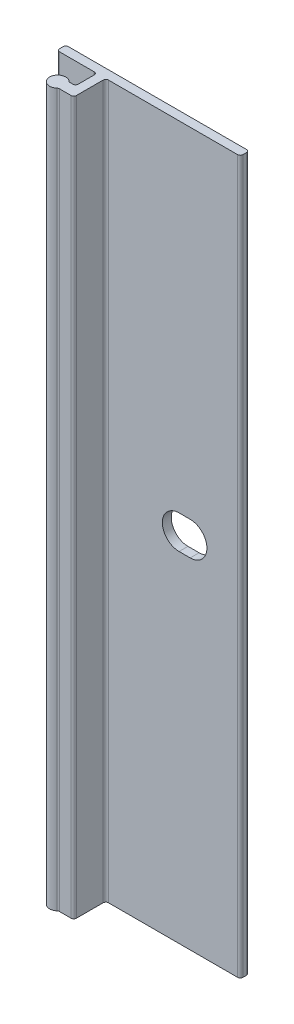
ISO-10303-21;
HEADER;
FILE_DESCRIPTION(('STEP AP214'),'2;1');
FILE_NAME('part.step','',(''),(''),'','','');
FILE_SCHEMA(('AUTOMOTIVE_DESIGN { 1 0 10303 214 1 1 1 1 }'));
ENDSEC;
DATA;
#1=APPLICATION_CONTEXT('core data for automotive mechanical design processes');
#2=APPLICATION_PROTOCOL_DEFINITION('international standard','automotive_design',2000,#1);
#3=PRODUCT_CONTEXT('',#1,'mechanical');
#4=PRODUCT('Part','Part','',(#3));
#5=PRODUCT_RELATED_PRODUCT_CATEGORY('part','',(#4));
#6=PRODUCT_DEFINITION_FORMATION('','',#4);
#7=PRODUCT_DEFINITION_CONTEXT('part definition',#1,'design');
#8=PRODUCT_DEFINITION('design','',#6,#7);
#9=PRODUCT_DEFINITION_SHAPE('','',#8);
#10=(LENGTH_UNIT() NAMED_UNIT(*) SI_UNIT(.MILLI.,.METRE.));
#11=(NAMED_UNIT(*) PLANE_ANGLE_UNIT() SI_UNIT($,.RADIAN.));
#12=(NAMED_UNIT(*) SI_UNIT($,.STERADIAN.) SOLID_ANGLE_UNIT());
#13=UNCERTAINTY_MEASURE_WITH_UNIT(LENGTH_MEASURE(1.E-05),#10,'distance_accuracy_value','');
#14=(GEOMETRIC_REPRESENTATION_CONTEXT(3) GLOBAL_UNCERTAINTY_ASSIGNED_CONTEXT((#13)) GLOBAL_UNIT_ASSIGNED_CONTEXT((#10,
#11,#12)) REPRESENTATION_CONTEXT('',''));
#15=CARTESIAN_POINT('',(0.,0.,0.));
#16=DIRECTION('',(0.,0.,1.));
#17=DIRECTION('',(1.,0.,0.));
#18=AXIS2_PLACEMENT_3D('',#15,#16,#17);
#19=CARTESIAN_POINT('',(-5.33400000000001,50.8,0.381));
#20=DIRECTION('',(0.,-1.,0.));
#21=DIRECTION('',(0.,0.,-1.));
#22=AXIS2_PLACEMENT_3D('',#19,#20,#21);
#23=CYLINDRICAL_SURFACE('',#22,0.381);
#24=CARTESIAN_POINT('',(-5.33400000000001,-50.8,0.381));
#25=DIRECTION('',(0.,1.,0.));
#26=DIRECTION('',(0.,0.,-1.));
#27=AXIS2_PLACEMENT_3D('',#24,#25,#26);
#28=CIRCLE('',#27,0.381);
#29=CARTESIAN_POINT('',(-5.33400000000001,-50.8,0.));
#30=VERTEX_POINT('',#29);
#31=CARTESIAN_POINT('',(-5.71500000000001,-50.8,0.381));
#32=VERTEX_POINT('',#31);
#33=EDGE_CURVE('E239',#30,#32,#28,.T.);
#34=ORIENTED_EDGE('',*,*,#33,.T.);
#35=DIRECTION('',(0.,-1.,0.));
#36=VECTOR('',#35,1.);
#37=CARTESIAN_POINT('',(-5.71500000000001,50.8,0.381));
#38=LINE('',#37,#36);
#39=CARTESIAN_POINT('',(-5.71500000000001,50.8,0.381));
#40=VERTEX_POINT('',#39);
#41=EDGE_CURVE('E13',#40,#32,#38,.T.);
#42=ORIENTED_EDGE('',*,*,#41,.F.);
#43=CARTESIAN_POINT('',(-5.33400000000001,50.8,0.381));
#44=DIRECTION('',(0.,1.,0.));
#45=DIRECTION('',(0.,0.,-1.));
#46=AXIS2_PLACEMENT_3D('',#43,#44,#45);
#47=CIRCLE('',#46,0.381);
#48=CARTESIAN_POINT('',(-5.33400000000001,50.8,0.));
#49=VERTEX_POINT('',#48);
#50=EDGE_CURVE('E243',#49,#40,#47,.T.);
#51=ORIENTED_EDGE('',*,*,#50,.F.);
#52=DIRECTION('',(0.,-1.,0.));
#53=VECTOR('',#52,1.);
#54=CARTESIAN_POINT('',(-5.33400000000001,50.8,0.));
#55=LINE('',#54,#53);
#56=EDGE_CURVE('E285',#49,#30,#55,.T.);
#57=ORIENTED_EDGE('',*,*,#56,.T.);
#58=EDGE_LOOP('',(#34,#42,#51,#57));
#59=FACE_BOUND('',#58,.T.);
#60=ADVANCED_FACE('F46',(#59),#23,.T.);
#61=CARTESIAN_POINT('',(-5.71500000000001,50.8,0.889000000000005));
#62=DIRECTION('',(1.,0.,0.));
#63=DIRECTION('',(0.,0.,-1.));
#64=AXIS2_PLACEMENT_3D('',#61,#62,#63);
#65=PLANE('',#64);
#66=DIRECTION('',(0.,0.,1.));
#67=VECTOR('',#66,1.);
#68=CARTESIAN_POINT('',(-5.71500000000001,-50.8,0.889000000000005));
#69=LINE('',#68,#67);
#70=CARTESIAN_POINT('',(-5.71500000000001,-50.8,0.889000000000005));
#71=VERTEX_POINT('',#70);
#72=EDGE_CURVE('E288',#32,#71,#69,.T.);
#73=ORIENTED_EDGE('',*,*,#72,.T.);
#74=DIRECTION('',(0.,-1.,0.));
#75=VECTOR('',#74,1.);
#76=CARTESIAN_POINT('',(-5.71500000000001,50.8,0.889000000000005));
#77=LINE('',#76,#75);
#78=CARTESIAN_POINT('',(-5.71500000000001,50.8,0.889000000000005));
#79=VERTEX_POINT('',#78);
#80=EDGE_CURVE('E53',#79,#71,#77,.T.);
#81=ORIENTED_EDGE('',*,*,#80,.F.);
#82=DIRECTION('',(0.,0.,1.));
#83=VECTOR('',#82,1.);
#84=CARTESIAN_POINT('',(-5.71500000000001,50.8,0.889000000000005));
#85=LINE('',#84,#83);
#86=EDGE_CURVE('E246',#40,#79,#85,.T.);
#87=ORIENTED_EDGE('',*,*,#86,.F.);
#88=ORIENTED_EDGE('',*,*,#41,.T.);
#89=EDGE_LOOP('',(#73,#81,#87,#88));
#90=FACE_BOUND('',#89,.T.);
#91=ADVANCED_FACE('F405',(#90),#65,.F.);
#92=CARTESIAN_POINT('',(-5.33400000000001,50.8,0.889000000000004));
#93=DIRECTION('',(0.,-1.,0.));
#94=DIRECTION('',(0.,0.,-1.));
#95=AXIS2_PLACEMENT_3D('',#92,#93,#94);
#96=CYLINDRICAL_SURFACE('',#95,0.381);
#97=CARTESIAN_POINT('',(-5.33400000000001,-50.8,0.889000000000004));
#98=DIRECTION('',(0.,1.,0.));
#99=DIRECTION('',(0.,0.,-1.));
#100=AXIS2_PLACEMENT_3D('',#97,#98,#99);
#101=CIRCLE('',#100,0.381);
#102=CARTESIAN_POINT('',(-5.33400000000001,-50.8,1.27));
#103=VERTEX_POINT('',#102);
#104=EDGE_CURVE('E290',#71,#103,#101,.T.);
#105=ORIENTED_EDGE('',*,*,#104,.T.);
#106=DIRECTION('',(0.,-1.,0.));
#107=VECTOR('',#106,1.);
#108=CARTESIAN_POINT('',(-5.33400000000001,50.8,1.27));
#109=LINE('',#108,#107);
#110=CARTESIAN_POINT('',(-5.33400000000001,50.8,1.27));
#111=VERTEX_POINT('',#110);
#112=EDGE_CURVE('E375',#111,#103,#109,.T.);
#113=ORIENTED_EDGE('',*,*,#112,.F.);
#114=CARTESIAN_POINT('',(-5.33400000000001,50.8,0.889000000000004));
#115=DIRECTION('',(0.,1.,0.));
#116=DIRECTION('',(0.,0.,-1.));
#117=AXIS2_PLACEMENT_3D('',#114,#115,#116);
#118=CIRCLE('',#117,0.381);
#119=EDGE_CURVE('E249',#79,#111,#118,.T.);
#120=ORIENTED_EDGE('',*,*,#119,.F.);
#121=ORIENTED_EDGE('',*,*,#80,.T.);
#122=EDGE_LOOP('',(#105,#113,#120,#121));
#123=FACE_BOUND('',#122,.T.);
#124=ADVANCED_FACE('F382',(#123),#96,.T.);
#125=CARTESIAN_POINT('',(-0.381,50.8,1.27));
#126=DIRECTION('',(0.,0.,-1.));
#127=DIRECTION('',(-1.,0.,0.));
#128=AXIS2_PLACEMENT_3D('',#125,#126,#127);
#129=PLANE('',#128);
#130=DIRECTION('',(1.,0.,0.));
#131=VECTOR('',#130,1.);
#132=CARTESIAN_POINT('',(-0.381,-50.8,1.27));
#133=LINE('',#132,#131);
#134=CARTESIAN_POINT('',(-0.381,-50.8,1.27));
#135=VERTEX_POINT('',#134);
#136=EDGE_CURVE('E292',#103,#135,#133,.T.);
#137=ORIENTED_EDGE('',*,*,#136,.T.);
#138=DIRECTION('',(0.,-1.,0.));
#139=VECTOR('',#138,1.);
#140=CARTESIAN_POINT('',(-0.381,50.8,1.27));
#141=LINE('',#140,#139);
#142=CARTESIAN_POINT('',(-0.381,50.8,1.27));
#143=VERTEX_POINT('',#142);
#144=EDGE_CURVE('E372',#143,#135,#141,.T.);
#145=ORIENTED_EDGE('',*,*,#144,.F.);
#146=DIRECTION('',(1.,0.,0.));
#147=VECTOR('',#146,1.);
#148=CARTESIAN_POINT('',(-0.381,50.8,1.27));
#149=LINE('',#148,#147);
#150=EDGE_CURVE('E251',#111,#143,#149,.T.);
#151=ORIENTED_EDGE('',*,*,#150,.F.);
#152=ORIENTED_EDGE('',*,*,#112,.T.);
#153=EDGE_LOOP('',(#137,#145,#151,#152));
#154=FACE_BOUND('',#153,.T.);
#155=ADVANCED_FACE('F393',(#154),#129,.F.);
#156=CARTESIAN_POINT('',(-0.381,50.8,1.651));
#157=DIRECTION('',(0.,-1.,0.));
#158=DIRECTION('',(0.,0.,-1.));
#159=AXIS2_PLACEMENT_3D('',#156,#157,#158);
#160=CYLINDRICAL_SURFACE('',#159,0.381);
#161=CARTESIAN_POINT('',(-0.381,-50.8,1.651));
#162=DIRECTION('',(0.,-1.,0.));
#163=DIRECTION('',(0.,0.,-1.));
#164=AXIS2_PLACEMENT_3D('',#161,#162,#163);
#165=CIRCLE('',#164,0.381);
#166=CARTESIAN_POINT('',(0.,-50.8,1.651));
#167=VERTEX_POINT('',#166);
#168=EDGE_CURVE('E294',#135,#167,#165,.T.);
#169=ORIENTED_EDGE('',*,*,#168,.T.);
#170=DIRECTION('',(0.,-1.,0.));
#171=VECTOR('',#170,1.);
#172=CARTESIAN_POINT('',(0.,50.8,1.651));
#173=LINE('',#172,#171);
#174=CARTESIAN_POINT('',(0.,50.8,1.651));
#175=VERTEX_POINT('',#174);
#176=EDGE_CURVE('E369',#175,#167,#173,.T.);
#177=ORIENTED_EDGE('',*,*,#176,.F.);
#178=CARTESIAN_POINT('',(-0.381,50.8,1.651));
#179=DIRECTION('',(0.,-1.,0.));
#180=DIRECTION('',(0.,0.,-1.));
#181=AXIS2_PLACEMENT_3D('',#178,#179,#180);
#182=CIRCLE('',#181,0.381);
#183=EDGE_CURVE('E253',#143,#175,#182,.T.);
#184=ORIENTED_EDGE('',*,*,#183,.F.);
#185=ORIENTED_EDGE('',*,*,#144,.T.);
#186=EDGE_LOOP('',(#169,#177,#184,#185));
#187=FACE_BOUND('',#186,.T.);
#188=ADVANCED_FACE('F397',(#187),#160,.F.);
#189=CARTESIAN_POINT('',(0.,50.8,1.651));
#190=DIRECTION('',(1.,0.,0.));
#191=DIRECTION('',(0.,0.,-1.));
#192=AXIS2_PLACEMENT_3D('',#189,#190,#191);
#193=PLANE('',#192);
#194=DIRECTION('',(0.,0.,1.));
#195=VECTOR('',#194,1.);
#196=CARTESIAN_POINT('',(0.,-50.8,1.651));
#197=LINE('',#196,#195);
#198=CARTESIAN_POINT('',(0.,-50.8,3.937));
#199=VERTEX_POINT('',#198);
#200=EDGE_CURVE('E296',#167,#199,#197,.T.);
#201=ORIENTED_EDGE('',*,*,#200,.T.);
#202=DIRECTION('',(0.,-1.,0.));
#203=VECTOR('',#202,1.);
#204=CARTESIAN_POINT('',(0.,50.8,3.937));
#205=LINE('',#204,#203);
#206=CARTESIAN_POINT('',(0.,50.8,3.937));
#207=VERTEX_POINT('',#206);
#208=EDGE_CURVE('E366',#207,#199,#205,.T.);
#209=ORIENTED_EDGE('',*,*,#208,.F.);
#210=DIRECTION('',(0.,0.,1.));
#211=VECTOR('',#210,1.);
#212=CARTESIAN_POINT('',(0.,50.8,1.651));
#213=LINE('',#212,#211);
#214=EDGE_CURVE('E255',#175,#207,#213,.T.);
#215=ORIENTED_EDGE('',*,*,#214,.F.);
#216=ORIENTED_EDGE('',*,*,#176,.T.);
#217=EDGE_LOOP('',(#201,#209,#215,#216));
#218=FACE_BOUND('',#217,.T.);
#219=ADVANCED_FACE('F476',(#218),#193,.F.);
#220=CARTESIAN_POINT('',(-0.381,50.8,3.937));
#221=DIRECTION('',(0.,-1.,0.));
#222=DIRECTION('',(0.,0.,-1.));
#223=AXIS2_PLACEMENT_3D('',#220,#221,#222);
#224=CYLINDRICAL_SURFACE('',#223,0.381);
#225=CARTESIAN_POINT('',(-0.381,-50.8,3.937));
#226=DIRECTION('',(0.,-1.,0.));
#227=DIRECTION('',(0.,0.,-1.));
#228=AXIS2_PLACEMENT_3D('',#225,#226,#227);
#229=CIRCLE('',#228,0.381);
#230=CARTESIAN_POINT('',(-0.381,-50.8,4.318));
#231=VERTEX_POINT('',#230);
#232=EDGE_CURVE('E298',#199,#231,#229,.T.);
#233=ORIENTED_EDGE('',*,*,#232,.T.);
#234=DIRECTION('',(0.,-1.,0.));
#235=VECTOR('',#234,1.);
#236=CARTESIAN_POINT('',(-0.381,50.8,4.318));
#237=LINE('',#236,#235);
#238=CARTESIAN_POINT('',(-0.381,50.8,4.318));
#239=VERTEX_POINT('',#238);
#240=EDGE_CURVE('E363',#239,#231,#237,.T.);
#241=ORIENTED_EDGE('',*,*,#240,.F.);
#242=CARTESIAN_POINT('',(-0.381,50.8,3.937));
#243=DIRECTION('',(0.,-1.,0.));
#244=DIRECTION('',(0.,0.,-1.));
#245=AXIS2_PLACEMENT_3D('',#242,#243,#244);
#246=CIRCLE('',#245,0.381);
#247=EDGE_CURVE('E257',#207,#239,#246,.T.);
#248=ORIENTED_EDGE('',*,*,#247,.F.);
#249=ORIENTED_EDGE('',*,*,#208,.T.);
#250=EDGE_LOOP('',(#233,#241,#248,#249));
#251=FACE_BOUND('',#250,.T.);
#252=ADVANCED_FACE('F474',(#251),#224,.F.);
#253=CARTESIAN_POINT('',(-0.76996875048439,50.8,4.318));
#254=DIRECTION('',(0.,0.,1.));
#255=DIRECTION('',(1.,0.,0.));
#256=AXIS2_PLACEMENT_3D('',#253,#254,#255);
#257=PLANE('',#256);
#258=DIRECTION('',(-1.,0.,0.));
#259=VECTOR('',#258,1.);
#260=CARTESIAN_POINT('',(-0.76996875048439,-50.8,4.318));
#261=LINE('',#260,#259);
#262=CARTESIAN_POINT('',(-0.76996875048439,-50.8,4.318));
#263=VERTEX_POINT('',#262);
#264=EDGE_CURVE('E300',#231,#263,#261,.T.);
#265=ORIENTED_EDGE('',*,*,#264,.T.);
#266=DIRECTION('',(0.,-1.,0.));
#267=VECTOR('',#266,1.);
#268=CARTESIAN_POINT('',(-0.76996875048439,50.8,4.318));
#269=LINE('',#268,#267);
#270=CARTESIAN_POINT('',(-0.76996875048439,50.8,4.318));
#271=VERTEX_POINT('',#270);
#272=EDGE_CURVE('E360',#271,#263,#269,.T.);
#273=ORIENTED_EDGE('',*,*,#272,.F.);
#274=DIRECTION('',(-1.,0.,0.));
#275=VECTOR('',#274,1.);
#276=CARTESIAN_POINT('',(-0.76996875048439,50.8,4.318));
#277=LINE('',#276,#275);
#278=EDGE_CURVE('E259',#239,#271,#277,.T.);
#279=ORIENTED_EDGE('',*,*,#278,.F.);
#280=ORIENTED_EDGE('',*,*,#240,.T.);
#281=EDGE_LOOP('',(#265,#273,#279,#280));
#282=FACE_BOUND('',#281,.T.);
#283=ADVANCED_FACE('F469',(#282),#257,.F.);
#284=CARTESIAN_POINT('',(-0.76996875048439,50.8,3.937));
#285=DIRECTION('',(0.,-1.,0.));
#286=DIRECTION('',(0.,0.,-1.));
#287=AXIS2_PLACEMENT_3D('',#284,#285,#286);
#288=CYLINDRICAL_SURFACE('',#287,0.381000000000001);
#289=CARTESIAN_POINT('',(-0.76996875048439,-50.8,3.937));
#290=DIRECTION('',(0.,-1.,0.));
#291=DIRECTION('',(0.,0.,-1.));
#292=AXIS2_PLACEMENT_3D('',#289,#290,#291);
#293=CIRCLE('',#292,0.381000000000001);
#294=CARTESIAN_POINT('',(-1.02197656286329,-50.8,4.22275));
#295=VERTEX_POINT('',#294);
#296=EDGE_CURVE('E302',#263,#295,#293,.T.);
#297=ORIENTED_EDGE('',*,*,#296,.T.);
#298=DIRECTION('',(0.,-1.,0.));
#299=VECTOR('',#298,1.);
#300=CARTESIAN_POINT('',(-1.02197656286329,50.8,4.22275));
#301=LINE('',#300,#299);
#302=CARTESIAN_POINT('',(-1.02197656286329,50.8,4.22275));
#303=VERTEX_POINT('',#302);
#304=EDGE_CURVE('E357',#303,#295,#301,.T.);
#305=ORIENTED_EDGE('',*,*,#304,.F.);
#306=CARTESIAN_POINT('',(-0.76996875048439,50.8,3.937));
#307=DIRECTION('',(0.,-1.,0.));
#308=DIRECTION('',(0.,0.,-1.));
#309=AXIS2_PLACEMENT_3D('',#306,#307,#308);
#310=CIRCLE('',#309,0.381000000000001);
#311=EDGE_CURVE('E261',#271,#303,#310,.T.);
#312=ORIENTED_EDGE('',*,*,#311,.F.);
#313=ORIENTED_EDGE('',*,*,#272,.T.);
#314=EDGE_LOOP('',(#297,#305,#312,#313));
#315=FACE_BOUND('',#314,.T.);
#316=ADVANCED_FACE('F464',(#315),#288,.F.);
#317=CARTESIAN_POINT('',(-1.778,50.8,5.08));
#318=DIRECTION('',(0.,-1.,0.));
#319=DIRECTION('',(0.,0.,-1.));
#320=AXIS2_PLACEMENT_3D('',#317,#318,#319);
#321=CYLINDRICAL_SURFACE('',#320,1.143);
#322=CARTESIAN_POINT('',(-1.778,-50.8,5.08));
#323=DIRECTION('',(0.,1.,0.));
#324=DIRECTION('',(0.,0.,1.));
#325=AXIS2_PLACEMENT_3D('',#322,#323,#324);
#326=CIRCLE('',#325,1.143);
#327=CARTESIAN_POINT('',(-1.02197656286329,-50.8,5.93725));
#328=VERTEX_POINT('',#327);
#329=EDGE_CURVE('E304',#295,#328,#326,.T.);
#330=ORIENTED_EDGE('',*,*,#329,.T.);
#331=DIRECTION('',(0.,-1.,0.));
#332=VECTOR('',#331,1.);
#333=CARTESIAN_POINT('',(-1.02197656286329,50.8,5.93725));
#334=LINE('',#333,#332);
#335=CARTESIAN_POINT('',(-1.02197656286329,50.8,5.93725));
#336=VERTEX_POINT('',#335);
#337=EDGE_CURVE('E354',#336,#328,#334,.T.);
#338=ORIENTED_EDGE('',*,*,#337,.F.);
#339=CARTESIAN_POINT('',(-1.778,50.8,5.08));
#340=DIRECTION('',(0.,1.,0.));
#341=DIRECTION('',(0.,0.,1.));
#342=AXIS2_PLACEMENT_3D('',#339,#340,#341);
#343=CIRCLE('',#342,1.143);
#344=EDGE_CURVE('E263',#303,#336,#343,.T.);
#345=ORIENTED_EDGE('',*,*,#344,.F.);
#346=ORIENTED_EDGE('',*,*,#304,.T.);
#347=EDGE_LOOP('',(#330,#338,#345,#346));
#348=FACE_BOUND('',#347,.T.);
#349=ADVANCED_FACE('F460',(#348),#321,.T.);
#350=CARTESIAN_POINT('',(-0.769968750484388,50.8,6.223));
#351=DIRECTION('',(0.,-1.,0.));
#352=DIRECTION('',(0.,0.,-1.));
#353=AXIS2_PLACEMENT_3D('',#350,#351,#352);
#354=CYLINDRICAL_SURFACE('',#353,0.381);
#355=CARTESIAN_POINT('',(-0.769968750484388,-50.8,6.223));
#356=DIRECTION('',(0.,-1.,0.));
#357=DIRECTION('',(0.,0.,1.));
#358=AXIS2_PLACEMENT_3D('',#355,#356,#357);
#359=CIRCLE('',#358,0.381);
#360=CARTESIAN_POINT('',(-0.769968750484388,-50.8,5.842));
#361=VERTEX_POINT('',#360);
#362=EDGE_CURVE('E306',#328,#361,#359,.T.);
#363=ORIENTED_EDGE('',*,*,#362,.T.);
#364=DIRECTION('',(0.,-1.,0.));
#365=VECTOR('',#364,1.);
#366=CARTESIAN_POINT('',(-0.769968750484388,50.8,5.842));
#367=LINE('',#366,#365);
#368=CARTESIAN_POINT('',(-0.769968750484388,50.8,5.842));
#369=VERTEX_POINT('',#368);
#370=EDGE_CURVE('E351',#369,#361,#367,.T.);
#371=ORIENTED_EDGE('',*,*,#370,.F.);
#372=CARTESIAN_POINT('',(-0.769968750484388,50.8,6.223));
#373=DIRECTION('',(0.,-1.,0.));
#374=DIRECTION('',(0.,0.,1.));
#375=AXIS2_PLACEMENT_3D('',#372,#373,#374);
#376=CIRCLE('',#375,0.381);
#377=EDGE_CURVE('E265',#336,#369,#376,.T.);
#378=ORIENTED_EDGE('',*,*,#377,.F.);
#379=ORIENTED_EDGE('',*,*,#337,.T.);
#380=EDGE_LOOP('',(#363,#371,#378,#379));
#381=FACE_BOUND('',#380,.T.);
#382=ADVANCED_FACE('F455',(#381),#354,.F.);
#383=CARTESIAN_POINT('',(-0.769968750484388,50.8,5.842));
#384=DIRECTION('',(0.,0.,-1.));
#385=DIRECTION('',(-1.,0.,0.));
#386=AXIS2_PLACEMENT_3D('',#383,#384,#385);
#387=PLANE('',#386);
#388=DIRECTION('',(1.,0.,0.));
#389=VECTOR('',#388,1.);
#390=CARTESIAN_POINT('',(-0.769968750484388,-50.8,5.842));
#391=LINE('',#390,#389);
#392=CARTESIAN_POINT('',(0.889,-50.8,5.842));
#393=VERTEX_POINT('',#392);
#394=EDGE_CURVE('E308',#361,#393,#391,.T.);
#395=ORIENTED_EDGE('',*,*,#394,.T.);
#396=DIRECTION('',(0.,-1.,0.));
#397=VECTOR('',#396,1.);
#398=CARTESIAN_POINT('',(0.889,50.8,5.842));
#399=LINE('',#398,#397);
#400=CARTESIAN_POINT('',(0.889,50.8,5.842));
#401=VERTEX_POINT('',#400);
#402=EDGE_CURVE('E348',#401,#393,#399,.T.);
#403=ORIENTED_EDGE('',*,*,#402,.F.);
#404=DIRECTION('',(1.,0.,0.));
#405=VECTOR('',#404,1.);
#406=CARTESIAN_POINT('',(-0.769968750484388,50.8,5.842));
#407=LINE('',#406,#405);
#408=EDGE_CURVE('E267',#369,#401,#407,.T.);
#409=ORIENTED_EDGE('',*,*,#408,.F.);
#410=ORIENTED_EDGE('',*,*,#370,.T.);
#411=EDGE_LOOP('',(#395,#403,#409,#410));
#412=FACE_BOUND('',#411,.T.);
#413=ADVANCED_FACE('F449',(#412),#387,.F.);
#414=CARTESIAN_POINT('',(0.889,50.8,5.461));
#415=DIRECTION('',(0.,-1.,0.));
#416=DIRECTION('',(0.,0.,-1.));
#417=AXIS2_PLACEMENT_3D('',#414,#415,#416);
#418=CYLINDRICAL_SURFACE('',#417,0.381);
#419=CARTESIAN_POINT('',(0.889,-50.8,5.461));
#420=DIRECTION('',(0.,1.,0.));
#421=DIRECTION('',(0.,0.,1.));
#422=AXIS2_PLACEMENT_3D('',#419,#420,#421);
#423=CIRCLE('',#422,0.381);
#424=CARTESIAN_POINT('',(1.27,-50.8,5.461));
#425=VERTEX_POINT('',#424);
#426=EDGE_CURVE('E310',#393,#425,#423,.T.);
#427=ORIENTED_EDGE('',*,*,#426,.T.);
#428=DIRECTION('',(0.,-1.,0.));
#429=VECTOR('',#428,1.);
#430=CARTESIAN_POINT('',(1.27,50.8,5.461));
#431=LINE('',#430,#429);
#432=CARTESIAN_POINT('',(1.27,50.8,5.461));
#433=VERTEX_POINT('',#432);
#434=EDGE_CURVE('E345',#433,#425,#431,.T.);
#435=ORIENTED_EDGE('',*,*,#434,.F.);
#436=CARTESIAN_POINT('',(0.889,50.8,5.461));
#437=DIRECTION('',(0.,1.,0.));
#438=DIRECTION('',(0.,0.,1.));
#439=AXIS2_PLACEMENT_3D('',#436,#437,#438);
#440=CIRCLE('',#439,0.381);
#441=EDGE_CURVE('E269',#401,#433,#440,.T.);
#442=ORIENTED_EDGE('',*,*,#441,.F.);
#443=ORIENTED_EDGE('',*,*,#402,.T.);
#444=EDGE_LOOP('',(#427,#435,#442,#443));
#445=FACE_BOUND('',#444,.T.);
#446=ADVANCED_FACE('F445',(#445),#418,.T.);
#447=CARTESIAN_POINT('',(1.27,50.8,1.651));
#448=DIRECTION('',(-1.,0.,0.));
#449=DIRECTION('',(0.,0.,1.));
#450=AXIS2_PLACEMENT_3D('',#447,#448,#449);
#451=PLANE('',#450);
#452=DIRECTION('',(0.,0.,-1.));
#453=VECTOR('',#452,1.);
#454=CARTESIAN_POINT('',(1.27,-50.8,1.651));
#455=LINE('',#454,#453);
#456=CARTESIAN_POINT('',(1.27,-50.8,1.651));
#457=VERTEX_POINT('',#456);
#458=EDGE_CURVE('E312',#425,#457,#455,.T.);
#459=ORIENTED_EDGE('',*,*,#458,.T.);
#460=DIRECTION('',(0.,-1.,0.));
#461=VECTOR('',#460,1.);
#462=CARTESIAN_POINT('',(1.27,50.8,1.651));
#463=LINE('',#462,#461);
#464=CARTESIAN_POINT('',(1.27,50.8,1.651));
#465=VERTEX_POINT('',#464);
#466=EDGE_CURVE('E342',#465,#457,#463,.T.);
#467=ORIENTED_EDGE('',*,*,#466,.F.);
#468=DIRECTION('',(0.,0.,-1.));
#469=VECTOR('',#468,1.);
#470=CARTESIAN_POINT('',(1.27,50.8,1.651));
#471=LINE('',#470,#469);
#472=EDGE_CURVE('E271',#433,#465,#471,.T.);
#473=ORIENTED_EDGE('',*,*,#472,.F.);
#474=ORIENTED_EDGE('',*,*,#434,.T.);
#475=EDGE_LOOP('',(#459,#467,#473,#474));
#476=FACE_BOUND('',#475,.T.);
#477=ADVANCED_FACE('F440',(#476),#451,.F.);
#478=CARTESIAN_POINT('',(1.651,50.8,1.651));
#479=DIRECTION('',(0.,-1.,0.));
#480=DIRECTION('',(0.,0.,-1.));
#481=AXIS2_PLACEMENT_3D('',#478,#479,#480);
#482=CYLINDRICAL_SURFACE('',#481,0.381);
#483=CARTESIAN_POINT('',(1.651,-50.8,1.651));
#484=DIRECTION('',(0.,-1.,0.));
#485=DIRECTION('',(0.,0.,1.));
#486=AXIS2_PLACEMENT_3D('',#483,#484,#485);
#487=CIRCLE('',#486,0.381);
#488=CARTESIAN_POINT('',(1.651,-50.8,1.27));
#489=VERTEX_POINT('',#488);
#490=EDGE_CURVE('E314',#457,#489,#487,.T.);
#491=ORIENTED_EDGE('',*,*,#490,.T.);
#492=DIRECTION('',(0.,-1.,0.));
#493=VECTOR('',#492,1.);
#494=CARTESIAN_POINT('',(1.651,50.8,1.27));
#495=LINE('',#494,#493);
#496=CARTESIAN_POINT('',(1.651,50.8,1.27));
#497=VERTEX_POINT('',#496);
#498=EDGE_CURVE('E339',#497,#489,#495,.T.);
#499=ORIENTED_EDGE('',*,*,#498,.F.);
#500=CARTESIAN_POINT('',(1.651,50.8,1.651));
#501=DIRECTION('',(0.,-1.,0.));
#502=DIRECTION('',(0.,0.,1.));
#503=AXIS2_PLACEMENT_3D('',#500,#501,#502);
#504=CIRCLE('',#503,0.381);
#505=EDGE_CURVE('E273',#465,#497,#504,.T.);
#506=ORIENTED_EDGE('',*,*,#505,.F.);
#507=ORIENTED_EDGE('',*,*,#466,.T.);
#508=EDGE_LOOP('',(#491,#499,#506,#507));
#509=FACE_BOUND('',#508,.T.);
#510=ADVANCED_FACE('F434',(#509),#482,.F.);
#511=CARTESIAN_POINT('',(20.066,50.8,1.27));
#512=DIRECTION('',(0.,0.,-1.));
#513=DIRECTION('',(-1.,0.,0.));
#514=AXIS2_PLACEMENT_3D('',#511,#512,#513);
#515=PLANE('',#514);
#516=DIRECTION('',(1.,0.,0.));
#517=VECTOR('',#516,1.);
#518=CARTESIAN_POINT('',(11.71575,-2.38125,1.27));
#519=LINE('',#518,#517);
#520=CARTESIAN_POINT('',(11.71575,-2.38125,1.27));
#521=VERTEX_POINT('',#520);
#522=CARTESIAN_POINT('',(13.30325,-2.38125,1.27));
#523=VERTEX_POINT('',#522);
#524=EDGE_CURVE('E233',#521,#523,#519,.T.);
#525=ORIENTED_EDGE('',*,*,#524,.F.);
#526=CARTESIAN_POINT('',(11.71575,0.,1.27));
#527=DIRECTION('',(0.,0.,1.));
#528=DIRECTION('',(1.,0.,0.));
#529=AXIS2_PLACEMENT_3D('',#526,#527,#528);
#530=CIRCLE('',#529,2.38125);
#531=CARTESIAN_POINT('',(11.71575,2.38125,1.27));
#532=VERTEX_POINT('',#531);
#533=EDGE_CURVE('E60',#532,#521,#530,.T.);
#534=ORIENTED_EDGE('',*,*,#533,.F.);
#535=DIRECTION('',(-1.,0.,0.));
#536=VECTOR('',#535,1.);
#537=CARTESIAN_POINT('',(11.71575,2.38125,1.27));
#538=LINE('',#537,#536);
#539=CARTESIAN_POINT('',(13.30325,2.38125,1.27));
#540=VERTEX_POINT('',#539);
#541=EDGE_CURVE('E224',#540,#532,#538,.T.);
#542=ORIENTED_EDGE('',*,*,#541,.F.);
#543=CARTESIAN_POINT('',(13.30325,0.,1.27));
#544=DIRECTION('',(0.,0.,1.));
#545=DIRECTION('',(1.,0.,0.));
#546=AXIS2_PLACEMENT_3D('',#543,#544,#545);
#547=CIRCLE('',#546,2.38125);
#548=EDGE_CURVE('E227',#523,#540,#547,.T.);
#549=ORIENTED_EDGE('',*,*,#548,.F.);
#550=EDGE_LOOP('',(#525,#534,#542,#549));
#551=FACE_BOUND('',#550,.T.);
#552=DIRECTION('',(1.,0.,0.));
#553=VECTOR('',#552,1.);
#554=CARTESIAN_POINT('',(20.066,-50.8,1.27));
#555=LINE('',#554,#553);
#556=CARTESIAN_POINT('',(20.066,-50.8,1.27));
#557=VERTEX_POINT('',#556);
#558=EDGE_CURVE('E316',#489,#557,#555,.T.);
#559=ORIENTED_EDGE('',*,*,#558,.T.);
#560=DIRECTION('',(0.,-1.,0.));
#561=VECTOR('',#560,1.);
#562=CARTESIAN_POINT('',(20.066,50.8,1.27));
#563=LINE('',#562,#561);
#564=CARTESIAN_POINT('',(20.066,50.8,1.27));
#565=VERTEX_POINT('',#564);
#566=EDGE_CURVE('E336',#565,#557,#563,.T.);
#567=ORIENTED_EDGE('',*,*,#566,.F.);
#568=DIRECTION('',(1.,0.,0.));
#569=VECTOR('',#568,1.);
#570=CARTESIAN_POINT('',(20.066,50.8,1.27));
#571=LINE('',#570,#569);
#572=EDGE_CURVE('E275',#497,#565,#571,.T.);
#573=ORIENTED_EDGE('',*,*,#572,.F.);
#574=ORIENTED_EDGE('',*,*,#498,.T.);
#575=EDGE_LOOP('',(#559,#567,#573,#574));
#576=FACE_BOUND('',#575,.T.);
#577=ADVANCED_FACE('F430',(#551,#576),#515,.F.);
#578=CARTESIAN_POINT('',(20.066,50.8,0.889000000000001));
#579=DIRECTION('',(0.,-1.,0.));
#580=DIRECTION('',(0.,0.,-1.));
#581=AXIS2_PLACEMENT_3D('',#578,#579,#580);
#582=CYLINDRICAL_SURFACE('',#581,0.380999999999998);
#583=CARTESIAN_POINT('',(20.066,-50.8,0.889000000000001));
#584=DIRECTION('',(0.,1.,0.));
#585=DIRECTION('',(0.,0.,-1.));
#586=AXIS2_PLACEMENT_3D('',#583,#584,#585);
#587=CIRCLE('',#586,0.380999999999998);
#588=CARTESIAN_POINT('',(20.447,-50.8,0.889000000000001));
#589=VERTEX_POINT('',#588);
#590=EDGE_CURVE('E318',#557,#589,#587,.T.);
#591=ORIENTED_EDGE('',*,*,#590,.T.);
#592=DIRECTION('',(0.,-1.,0.));
#593=VECTOR('',#592,1.);
#594=CARTESIAN_POINT('',(20.447,50.8,0.889000000000001));
#595=LINE('',#594,#593);
#596=CARTESIAN_POINT('',(20.447,50.8,0.889000000000001));
#597=VERTEX_POINT('',#596);
#598=EDGE_CURVE('E333',#597,#589,#595,.T.);
#599=ORIENTED_EDGE('',*,*,#598,.F.);
#600=CARTESIAN_POINT('',(20.066,50.8,0.889000000000001));
#601=DIRECTION('',(0.,1.,0.));
#602=DIRECTION('',(0.,0.,-1.));
#603=AXIS2_PLACEMENT_3D('',#600,#601,#602);
#604=CIRCLE('',#603,0.380999999999998);
#605=EDGE_CURVE('E277',#565,#597,#604,.T.);
#606=ORIENTED_EDGE('',*,*,#605,.F.);
#607=ORIENTED_EDGE('',*,*,#566,.T.);
#608=EDGE_LOOP('',(#591,#599,#606,#607));
#609=FACE_BOUND('',#608,.T.);
#610=ADVANCED_FACE('F425',(#609),#582,.T.);
#611=CARTESIAN_POINT('',(20.447,50.8,0.381));
#612=DIRECTION('',(-1.,0.,0.));
#613=DIRECTION('',(0.,0.,1.));
#614=AXIS2_PLACEMENT_3D('',#611,#612,#613);
#615=PLANE('',#614);
#616=DIRECTION('',(0.,0.,-1.));
#617=VECTOR('',#616,1.);
#618=CARTESIAN_POINT('',(20.447,-50.8,0.381));
#619=LINE('',#618,#617);
#620=CARTESIAN_POINT('',(20.447,-50.8,0.381));
#621=VERTEX_POINT('',#620);
#622=EDGE_CURVE('E320',#589,#621,#619,.T.);
#623=ORIENTED_EDGE('',*,*,#622,.T.);
#624=DIRECTION('',(0.,-1.,0.));
#625=VECTOR('',#624,1.);
#626=CARTESIAN_POINT('',(20.447,50.8,0.381));
#627=LINE('',#626,#625);
#628=CARTESIAN_POINT('',(20.447,50.8,0.381));
#629=VERTEX_POINT('',#628);
#630=EDGE_CURVE('E330',#629,#621,#627,.T.);
#631=ORIENTED_EDGE('',*,*,#630,.F.);
#632=DIRECTION('',(0.,0.,-1.));
#633=VECTOR('',#632,1.);
#634=CARTESIAN_POINT('',(20.447,50.8,0.381));
#635=LINE('',#634,#633);
#636=EDGE_CURVE('E279',#597,#629,#635,.T.);
#637=ORIENTED_EDGE('',*,*,#636,.F.);
#638=ORIENTED_EDGE('',*,*,#598,.T.);
#639=EDGE_LOOP('',(#623,#631,#637,#638));
#640=FACE_BOUND('',#639,.T.);
#641=ADVANCED_FACE('F419',(#640),#615,.F.);
#642=CARTESIAN_POINT('',(20.066,50.8,0.381));
#643=DIRECTION('',(0.,-1.,0.));
#644=DIRECTION('',(0.,0.,-1.));
#645=AXIS2_PLACEMENT_3D('',#642,#643,#644);
#646=CYLINDRICAL_SURFACE('',#645,0.381);
#647=CARTESIAN_POINT('',(20.066,-50.8,0.381));
#648=DIRECTION('',(0.,1.,0.));
#649=DIRECTION('',(0.,0.,-1.));
#650=AXIS2_PLACEMENT_3D('',#647,#648,#649);
#651=CIRCLE('',#650,0.381);
#652=CARTESIAN_POINT('',(20.066,-50.8,0.));
#653=VERTEX_POINT('',#652);
#654=EDGE_CURVE('E322',#621,#653,#651,.T.);
#655=ORIENTED_EDGE('',*,*,#654,.T.);
#656=DIRECTION('',(0.,-1.,0.));
#657=VECTOR('',#656,1.);
#658=CARTESIAN_POINT('',(20.066,50.8,0.));
#659=LINE('',#658,#657);
#660=CARTESIAN_POINT('',(20.066,50.8,0.));
#661=VERTEX_POINT('',#660);
#662=EDGE_CURVE('E327',#661,#653,#659,.T.);
#663=ORIENTED_EDGE('',*,*,#662,.F.);
#664=CARTESIAN_POINT('',(20.066,50.8,0.381));
#665=DIRECTION('',(0.,1.,0.));
#666=DIRECTION('',(0.,0.,-1.));
#667=AXIS2_PLACEMENT_3D('',#664,#665,#666);
#668=CIRCLE('',#667,0.381);
#669=EDGE_CURVE('E281',#629,#661,#668,.T.);
#670=ORIENTED_EDGE('',*,*,#669,.F.);
#671=ORIENTED_EDGE('',*,*,#630,.T.);
#672=EDGE_LOOP('',(#655,#663,#670,#671));
#673=FACE_BOUND('',#672,.T.);
#674=ADVANCED_FACE('F415',(#673),#646,.T.);
#675=CARTESIAN_POINT('',(-5.33400000000001,50.8,0.));
#676=DIRECTION('',(0.,0.,1.));
#677=DIRECTION('',(1.,0.,0.));
#678=AXIS2_PLACEMENT_3D('',#675,#676,#677);
#679=PLANE('',#678);
#680=DIRECTION('',(-1.,0.,0.));
#681=VECTOR('',#680,1.);
#682=CARTESIAN_POINT('',(11.71575,2.38125,0.));
#683=LINE('',#682,#681);
#684=CARTESIAN_POINT('',(13.30325,2.38125,0.));
#685=VERTEX_POINT('',#684);
#686=CARTESIAN_POINT('',(11.71575,2.38125,0.));
#687=VERTEX_POINT('',#686);
#688=EDGE_CURVE('E214',#685,#687,#683,.T.);
#689=ORIENTED_EDGE('',*,*,#688,.T.);
#690=CARTESIAN_POINT('',(11.71575,0.,0.));
#691=DIRECTION('',(0.,0.,1.));
#692=DIRECTION('',(1.,0.,0.));
#693=AXIS2_PLACEMENT_3D('',#690,#691,#692);
#694=CIRCLE('',#693,2.38125);
#695=CARTESIAN_POINT('',(11.71575,-2.38125,0.));
#696=VERTEX_POINT('',#695);
#697=EDGE_CURVE('E208',#687,#696,#694,.T.);
#698=ORIENTED_EDGE('',*,*,#697,.T.);
#699=DIRECTION('',(1.,0.,0.));
#700=VECTOR('',#699,1.);
#701=CARTESIAN_POINT('',(11.71575,-2.38125,0.));
#702=LINE('',#701,#700);
#703=CARTESIAN_POINT('',(13.30325,-2.38125,0.));
#704=VERTEX_POINT('',#703);
#705=EDGE_CURVE('E217',#696,#704,#702,.T.);
#706=ORIENTED_EDGE('',*,*,#705,.T.);
#707=CARTESIAN_POINT('',(13.30325,0.,0.));
#708=DIRECTION('',(0.,0.,1.));
#709=DIRECTION('',(1.,0.,0.));
#710=AXIS2_PLACEMENT_3D('',#707,#708,#709);
#711=CIRCLE('',#710,2.38125);
#712=EDGE_CURVE('E68',#704,#685,#711,.T.);
#713=ORIENTED_EDGE('',*,*,#712,.T.);
#714=EDGE_LOOP('',(#689,#698,#706,#713));
#715=FACE_BOUND('',#714,.T.);
#716=DIRECTION('',(-1.,0.,0.));
#717=VECTOR('',#716,1.);
#718=CARTESIAN_POINT('',(-5.33400000000001,-50.8,0.));
#719=LINE('',#718,#717);
#720=EDGE_CURVE('E247',#653,#30,#719,.T.);
#721=ORIENTED_EDGE('',*,*,#720,.T.);
#722=ORIENTED_EDGE('',*,*,#56,.F.);
#723=DIRECTION('',(-1.,0.,0.));
#724=VECTOR('',#723,1.);
#725=CARTESIAN_POINT('',(-5.33400000000001,50.8,0.));
#726=LINE('',#725,#724);
#727=EDGE_CURVE('E283',#661,#49,#726,.T.);
#728=ORIENTED_EDGE('',*,*,#727,.F.);
#729=ORIENTED_EDGE('',*,*,#662,.T.);
#730=EDGE_LOOP('',(#721,#722,#728,#729));
#731=FACE_BOUND('',#730,.T.);
#732=ADVANCED_FACE('F221',(#715,#731),#679,.F.);
#733=CARTESIAN_POINT('',(-5.33400000000001,50.8,0.381));
#734=DIRECTION('',(0.,-1.,0.));
#735=DIRECTION('',(0.,0.,-1.));
#736=AXIS2_PLACEMENT_3D('',#733,#734,#735);
#737=PLANE('',#736);
#738=ORIENTED_EDGE('',*,*,#50,.T.);
#739=ORIENTED_EDGE('',*,*,#86,.T.);
#740=ORIENTED_EDGE('',*,*,#119,.T.);
#741=ORIENTED_EDGE('',*,*,#150,.T.);
#742=ORIENTED_EDGE('',*,*,#183,.T.);
#743=ORIENTED_EDGE('',*,*,#214,.T.);
#744=ORIENTED_EDGE('',*,*,#247,.T.);
#745=ORIENTED_EDGE('',*,*,#278,.T.);
#746=ORIENTED_EDGE('',*,*,#311,.T.);
#747=ORIENTED_EDGE('',*,*,#344,.T.);
#748=ORIENTED_EDGE('',*,*,#377,.T.);
#749=ORIENTED_EDGE('',*,*,#408,.T.);
#750=ORIENTED_EDGE('',*,*,#441,.T.);
#751=ORIENTED_EDGE('',*,*,#472,.T.);
#752=ORIENTED_EDGE('',*,*,#505,.T.);
#753=ORIENTED_EDGE('',*,*,#572,.T.);
#754=ORIENTED_EDGE('',*,*,#605,.T.);
#755=ORIENTED_EDGE('',*,*,#636,.T.);
#756=ORIENTED_EDGE('',*,*,#669,.T.);
#757=ORIENTED_EDGE('',*,*,#727,.T.);
#758=EDGE_LOOP('',(#738,#739,#740,#741,#742,#743,#744,#745,#746,#747,#748,#749,#750,#751,#752,
#753,#754,#755,#756,#757));
#759=FACE_BOUND('',#758,.T.);
#760=ADVANCED_FACE('F401',(#759),#737,.F.);
#761=CARTESIAN_POINT('',(-5.33400000000001,-50.8,0.381));
#762=DIRECTION('',(0.,-1.,0.));
#763=DIRECTION('',(0.,0.,-1.));
#764=AXIS2_PLACEMENT_3D('',#761,#762,#763);
#765=PLANE('',#764);
#766=ORIENTED_EDGE('',*,*,#33,.F.);
#767=ORIENTED_EDGE('',*,*,#720,.F.);
#768=ORIENTED_EDGE('',*,*,#654,.F.);
#769=ORIENTED_EDGE('',*,*,#622,.F.);
#770=ORIENTED_EDGE('',*,*,#590,.F.);
#771=ORIENTED_EDGE('',*,*,#558,.F.);
#772=ORIENTED_EDGE('',*,*,#490,.F.);
#773=ORIENTED_EDGE('',*,*,#458,.F.);
#774=ORIENTED_EDGE('',*,*,#426,.F.);
#775=ORIENTED_EDGE('',*,*,#394,.F.);
#776=ORIENTED_EDGE('',*,*,#362,.F.);
#777=ORIENTED_EDGE('',*,*,#329,.F.);
#778=ORIENTED_EDGE('',*,*,#296,.F.);
#779=ORIENTED_EDGE('',*,*,#264,.F.);
#780=ORIENTED_EDGE('',*,*,#232,.F.);
#781=ORIENTED_EDGE('',*,*,#200,.F.);
#782=ORIENTED_EDGE('',*,*,#168,.F.);
#783=ORIENTED_EDGE('',*,*,#136,.F.);
#784=ORIENTED_EDGE('',*,*,#104,.F.);
#785=ORIENTED_EDGE('',*,*,#72,.F.);
#786=EDGE_LOOP('',(#766,#767,#768,#769,#770,#771,#772,#773,#774,#775,#776,#777,#778,#779,#780,
#781,#782,#783,#784,#785));
#787=FACE_BOUND('',#786,.T.);
#788=ADVANCED_FACE('F388',(#787),#765,.T.);
#789=CARTESIAN_POINT('',(11.71575,0.,0.));
#790=DIRECTION('',(0.,0.,1.));
#791=DIRECTION('',(1.,0.,0.));
#792=AXIS2_PLACEMENT_3D('',#789,#790,#791);
#793=CYLINDRICAL_SURFACE('',#792,2.38125);
#794=ORIENTED_EDGE('',*,*,#533,.T.);
#795=DIRECTION('',(0.,0.,1.));
#796=VECTOR('',#795,1.);
#797=CARTESIAN_POINT('',(11.71575,-2.38125,0.));
#798=LINE('',#797,#796);
#799=EDGE_CURVE('E204',#696,#521,#798,.T.);
#800=ORIENTED_EDGE('',*,*,#799,.F.);
#801=ORIENTED_EDGE('',*,*,#697,.F.);
#802=DIRECTION('',(0.,0.,1.));
#803=VECTOR('',#802,1.);
#804=CARTESIAN_POINT('',(11.71575,2.38125,0.));
#805=LINE('',#804,#803);
#806=EDGE_CURVE('E237',#687,#532,#805,.T.);
#807=ORIENTED_EDGE('',*,*,#806,.T.);
#808=EDGE_LOOP('',(#794,#800,#801,#807));
#809=FACE_BOUND('',#808,.T.);
#810=ADVANCED_FACE('F206',(#809),#793,.F.);
#811=CARTESIAN_POINT('',(11.71575,2.38125,0.));
#812=DIRECTION('',(0.,1.,0.));
#813=DIRECTION('',(-1.,0.,0.));
#814=AXIS2_PLACEMENT_3D('',#811,#812,#813);
#815=PLANE('',#814);
#816=ORIENTED_EDGE('',*,*,#541,.T.);
#817=ORIENTED_EDGE('',*,*,#806,.F.);
#818=ORIENTED_EDGE('',*,*,#688,.F.);
#819=DIRECTION('',(0.,0.,1.));
#820=VECTOR('',#819,1.);
#821=CARTESIAN_POINT('',(13.30325,2.38125,0.));
#822=LINE('',#821,#820);
#823=EDGE_CURVE('E240',#685,#540,#822,.T.);
#824=ORIENTED_EDGE('',*,*,#823,.T.);
#825=EDGE_LOOP('',(#816,#817,#818,#824));
#826=FACE_BOUND('',#825,.T.);
#827=ADVANCED_FACE('F643',(#826),#815,.F.);
#828=CARTESIAN_POINT('',(13.30325,0.,0.));
#829=DIRECTION('',(0.,0.,1.));
#830=DIRECTION('',(1.,0.,0.));
#831=AXIS2_PLACEMENT_3D('',#828,#829,#830);
#832=CYLINDRICAL_SURFACE('',#831,2.38125);
#833=ORIENTED_EDGE('',*,*,#548,.T.);
#834=ORIENTED_EDGE('',*,*,#823,.F.);
#835=ORIENTED_EDGE('',*,*,#712,.F.);
#836=DIRECTION('',(0.,0.,1.));
#837=VECTOR('',#836,1.);
#838=CARTESIAN_POINT('',(13.30325,-2.38125,0.));
#839=LINE('',#838,#837);
#840=EDGE_CURVE('E213',#704,#523,#839,.T.);
#841=ORIENTED_EDGE('',*,*,#840,.T.);
#842=EDGE_LOOP('',(#833,#834,#835,#841));
#843=FACE_BOUND('',#842,.T.);
#844=ADVANCED_FACE('F652',(#843),#832,.F.);
#845=CARTESIAN_POINT('',(11.71575,-2.38125,0.));
#846=DIRECTION('',(0.,-1.,0.));
#847=DIRECTION('',(1.,0.,0.));
#848=AXIS2_PLACEMENT_3D('',#845,#846,#847);
#849=PLANE('',#848);
#850=ORIENTED_EDGE('',*,*,#524,.T.);
#851=ORIENTED_EDGE('',*,*,#840,.F.);
#852=ORIENTED_EDGE('',*,*,#705,.F.);
#853=ORIENTED_EDGE('',*,*,#799,.T.);
#854=EDGE_LOOP('',(#850,#851,#852,#853));
#855=FACE_BOUND('',#854,.T.);
#856=ADVANCED_FACE('F218',(#855),#849,.F.);
#857=CLOSED_SHELL('',(#60,#91,#124,#155,#188,#219,#252,#283,#316,#349,#382,#413,#446,#477,#510,
#577,#610,#641,#674,#732,#760,#788,#810,#827,#844,#856));
#858=MANIFOLD_SOLID_BREP('B2',#857);
#859=ADVANCED_BREP_SHAPE_REPRESENTATION('',(#18,#858),#14);
#860=SHAPE_DEFINITION_REPRESENTATION(#9,#859);
ENDSEC;
END-ISO-10303-21;
